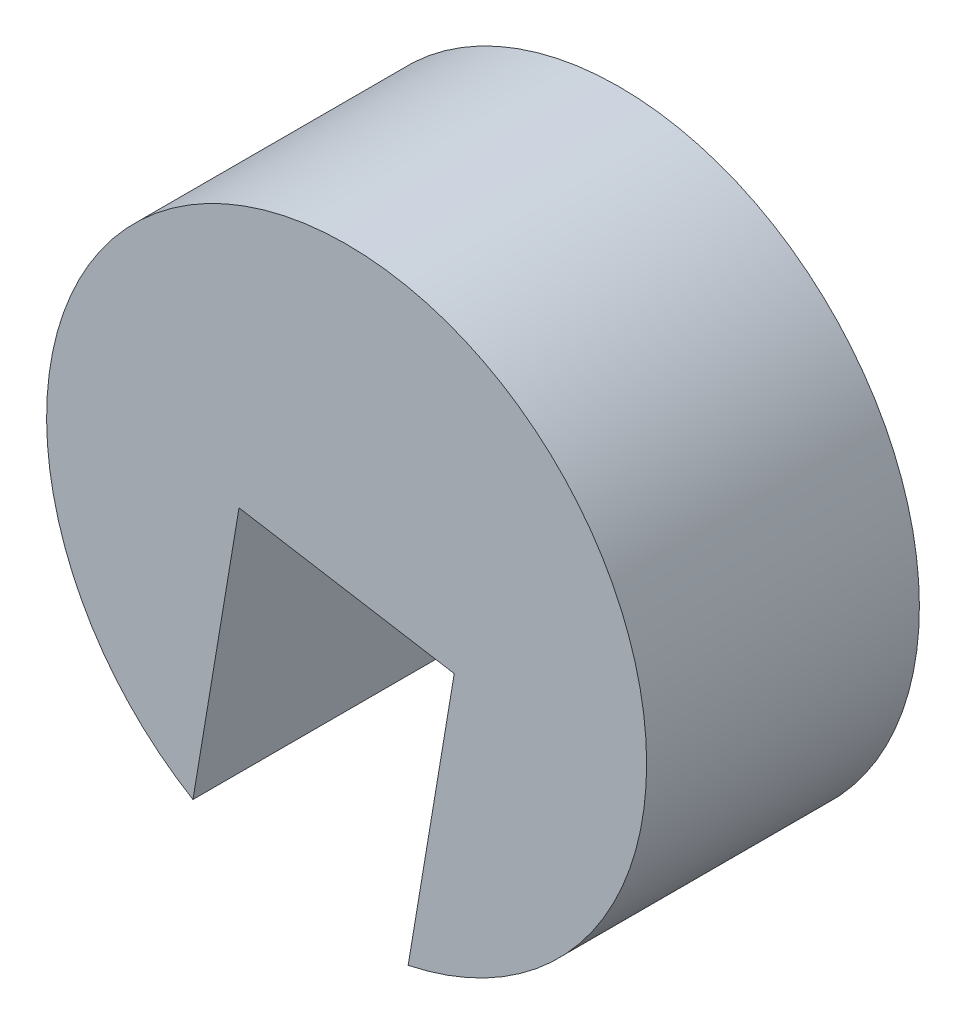
ISO-10303-21;
HEADER;
FILE_DESCRIPTION(('STEP AP214'),'2;1');
FILE_NAME('part.step','',(''),(''),'','','');
FILE_SCHEMA(('AUTOMOTIVE_DESIGN { 1 0 10303 214 1 1 1 1 }'));
ENDSEC;
DATA;
#1=APPLICATION_CONTEXT('core data for automotive mechanical design processes');
#2=APPLICATION_PROTOCOL_DEFINITION('international standard','automotive_design',2000,#1);
#3=PRODUCT_CONTEXT('',#1,'mechanical');
#4=PRODUCT('Part','Part','',(#3));
#5=PRODUCT_RELATED_PRODUCT_CATEGORY('part','',(#4));
#6=PRODUCT_DEFINITION_FORMATION('','',#4);
#7=PRODUCT_DEFINITION_CONTEXT('part definition',#1,'design');
#8=PRODUCT_DEFINITION('design','',#6,#7);
#9=PRODUCT_DEFINITION_SHAPE('','',#8);
#10=(LENGTH_UNIT() NAMED_UNIT(*) SI_UNIT(.MILLI.,.METRE.));
#11=(NAMED_UNIT(*) PLANE_ANGLE_UNIT() SI_UNIT($,.RADIAN.));
#12=(NAMED_UNIT(*) SI_UNIT($,.STERADIAN.) SOLID_ANGLE_UNIT());
#13=UNCERTAINTY_MEASURE_WITH_UNIT(LENGTH_MEASURE(1.E-05),#10,'distance_accuracy_value','');
#14=(GEOMETRIC_REPRESENTATION_CONTEXT(3) GLOBAL_UNCERTAINTY_ASSIGNED_CONTEXT((#13)) GLOBAL_UNIT_ASSIGNED_CONTEXT((#10,
#11,#12)) REPRESENTATION_CONTEXT('',''));
#15=CARTESIAN_POINT('',(0.,0.,0.));
#16=DIRECTION('',(0.,0.,1.));
#17=DIRECTION('',(1.,0.,0.));
#18=AXIS2_PLACEMENT_3D('',#15,#16,#17);
#19=CARTESIAN_POINT('',(0.,0.,5.));
#20=DIRECTION('',(0.,0.,-1.));
#21=DIRECTION('',(-1.,0.,0.));
#22=AXIS2_PLACEMENT_3D('',#19,#20,#21);
#23=CYLINDRICAL_SURFACE('',#22,5.5);
#24=CARTESIAN_POINT('',(0.,0.,5.));
#25=DIRECTION('',(0.,0.,1.));
#26=DIRECTION('',(1.,0.,0.));
#27=AXIS2_PLACEMENT_3D('',#24,#25,#26);
#28=CIRCLE('',#27,5.5);
#29=CARTESIAN_POINT('',(1.12806532229737,-5.38307241532474,5.));
#30=VERTEX_POINT('',#29);
#31=CARTESIAN_POINT('',(-2.81721330901617,-4.72369655794084,5.));
#32=VERTEX_POINT('',#31);
#33=EDGE_CURVE('E11',#30,#32,#28,.T.);
#34=ORIENTED_EDGE('',*,*,#33,.F.);
#35=DIRECTION('',(0.,0.,1.));
#36=VECTOR('',#35,1.);
#37=CARTESIAN_POINT('',(1.12806532229737,-5.38307241532474,0.));
#38=LINE('',#37,#36);
#39=CARTESIAN_POINT('',(1.12806532229737,-5.38307241532474,0.));
#40=VERTEX_POINT('',#39);
#41=EDGE_CURVE('E88',#40,#30,#38,.T.);
#42=ORIENTED_EDGE('',*,*,#41,.F.);
#43=CARTESIAN_POINT('',(0.,0.,0.));
#44=DIRECTION('',(0.,0.,1.));
#45=DIRECTION('',(1.,0.,0.));
#46=AXIS2_PLACEMENT_3D('',#43,#44,#45);
#47=CIRCLE('',#46,5.5);
#48=CARTESIAN_POINT('',(-2.81721330901617,-4.72369655794084,0.));
#49=VERTEX_POINT('',#48);
#50=EDGE_CURVE('E47',#40,#49,#47,.T.);
#51=ORIENTED_EDGE('',*,*,#50,.T.);
#52=DIRECTION('',(0.,0.,1.));
#53=VECTOR('',#52,1.);
#54=CARTESIAN_POINT('',(-2.81721330901617,-4.72369655794084,0.));
#55=LINE('',#54,#53);
#56=EDGE_CURVE('E80',#49,#32,#55,.T.);
#57=ORIENTED_EDGE('',*,*,#56,.T.);
#58=EDGE_LOOP('',(#34,#42,#51,#57));
#59=FACE_BOUND('',#58,.T.);
#60=ADVANCED_FACE('F39',(#59),#23,.T.);
#61=CARTESIAN_POINT('',(0.,0.,5.));
#62=DIRECTION('',(0.,0.,1.));
#63=DIRECTION('',(1.,0.,0.));
#64=AXIS2_PLACEMENT_3D('',#61,#62,#63);
#65=PLANE('',#64);
#66=DIRECTION('',(0.164843964345974,0.986319657828385,0.));
#67=VECTOR('',#66,1.);
#68=CARTESIAN_POINT('',(1.97263931565677,-0.329687928691948,5.));
#69=LINE('',#68,#67);
#70=CARTESIAN_POINT('',(1.97263931565677,-0.329687928691948,5.));
#71=VERTEX_POINT('',#70);
#72=EDGE_CURVE('E111',#30,#71,#69,.T.);
#73=ORIENTED_EDGE('',*,*,#72,.F.);
#74=ORIENTED_EDGE('',*,*,#33,.T.);
#75=DIRECTION('',(-0.164843964345974,-0.986319657828385,0.));
#76=VECTOR('',#75,1.);
#77=CARTESIAN_POINT('',(-1.97263931565677,0.329687928691948,5.));
#78=LINE('',#77,#76);
#79=CARTESIAN_POINT('',(-1.97263931565677,0.329687928691948,5.));
#80=VERTEX_POINT('',#79);
#81=EDGE_CURVE('E83',#80,#32,#78,.T.);
#82=ORIENTED_EDGE('',*,*,#81,.F.);
#83=DIRECTION('',(-0.986319657828385,0.164843964345974,0.));
#84=VECTOR('',#83,1.);
#85=CARTESIAN_POINT('',(0.,0.,5.));
#86=LINE('',#85,#84);
#87=EDGE_CURVE('E128',#71,#80,#86,.T.);
#88=ORIENTED_EDGE('',*,*,#87,.F.);
#89=EDGE_LOOP('',(#73,#74,#82,#88));
#90=FACE_BOUND('',#89,.T.);
#91=ADVANCED_FACE('F140',(#90),#65,.T.);
#92=CARTESIAN_POINT('',(0.,0.,0.));
#93=DIRECTION('',(0.,0.,1.));
#94=DIRECTION('',(1.,0.,0.));
#95=AXIS2_PLACEMENT_3D('',#92,#93,#94);
#96=PLANE('',#95);
#97=ORIENTED_EDGE('',*,*,#50,.F.);
#98=DIRECTION('',(0.164843964345974,0.986319657828385,0.));
#99=VECTOR('',#98,1.);
#100=CARTESIAN_POINT('',(1.97263931565677,-0.329687928691948,0.));
#101=LINE('',#100,#99);
#102=CARTESIAN_POINT('',(1.97263931565677,-0.329687928691948,0.));
#103=VERTEX_POINT('',#102);
#104=EDGE_CURVE('E98',#40,#103,#101,.T.);
#105=ORIENTED_EDGE('',*,*,#104,.T.);
#106=DIRECTION('',(-0.986319657828385,0.164843964345974,0.));
#107=VECTOR('',#106,1.);
#108=CARTESIAN_POINT('',(0.,0.,0.));
#109=LINE('',#108,#107);
#110=CARTESIAN_POINT('',(-1.97263931565677,0.329687928691948,0.));
#111=VERTEX_POINT('',#110);
#112=EDGE_CURVE('E96',#103,#111,#109,.T.);
#113=ORIENTED_EDGE('',*,*,#112,.T.);
#114=DIRECTION('',(-0.164843964345974,-0.986319657828385,0.));
#115=VECTOR('',#114,1.);
#116=CARTESIAN_POINT('',(-1.97263931565677,0.329687928691948,0.));
#117=LINE('',#116,#115);
#118=EDGE_CURVE('E54',#111,#49,#117,.T.);
#119=ORIENTED_EDGE('',*,*,#118,.T.);
#120=EDGE_LOOP('',(#97,#105,#113,#119));
#121=FACE_BOUND('',#120,.T.);
#122=ADVANCED_FACE('F94',(#121),#96,.F.);
#123=CARTESIAN_POINT('',(1.97263931565677,-0.329687928691948,0.));
#124=DIRECTION('',(0.986319657828385,-0.164843964345974,0.));
#125=DIRECTION('',(0.164843964345974,0.986319657828386,0.));
#126=AXIS2_PLACEMENT_3D('',#123,#124,#125);
#127=PLANE('',#126);
#128=ORIENTED_EDGE('',*,*,#72,.T.);
#129=DIRECTION('',(0.,0.,1.));
#130=VECTOR('',#129,1.);
#131=CARTESIAN_POINT('',(1.97263931565677,-0.329687928691948,0.));
#132=LINE('',#131,#130);
#133=EDGE_CURVE('E63',#103,#71,#132,.T.);
#134=ORIENTED_EDGE('',*,*,#133,.F.);
#135=ORIENTED_EDGE('',*,*,#104,.F.);
#136=ORIENTED_EDGE('',*,*,#41,.T.);
#137=EDGE_LOOP('',(#128,#134,#135,#136));
#138=FACE_BOUND('',#137,.T.);
#139=ADVANCED_FACE('F141',(#138),#127,.F.);
#140=CARTESIAN_POINT('',(-1.97263931565677,0.329687928691948,0.));
#141=DIRECTION('',(-0.986319657828385,0.164843964345974,0.));
#142=DIRECTION('',(-0.164843964345974,-0.986319657828385,0.));
#143=AXIS2_PLACEMENT_3D('',#140,#141,#142);
#144=PLANE('',#143);
#145=ORIENTED_EDGE('',*,*,#81,.T.);
#146=ORIENTED_EDGE('',*,*,#56,.F.);
#147=ORIENTED_EDGE('',*,*,#118,.F.);
#148=DIRECTION('',(0.,0.,1.));
#149=VECTOR('',#148,1.);
#150=CARTESIAN_POINT('',(-1.97263931565677,0.329687928691948,0.));
#151=LINE('',#150,#149);
#152=EDGE_CURVE('E89',#111,#80,#151,.T.);
#153=ORIENTED_EDGE('',*,*,#152,.T.);
#154=EDGE_LOOP('',(#145,#146,#147,#153));
#155=FACE_BOUND('',#154,.T.);
#156=ADVANCED_FACE('F81',(#155),#144,.F.);
#157=CARTESIAN_POINT('',(0.,0.,0.));
#158=DIRECTION('',(0.164843964345974,0.986319657828385,0.));
#159=DIRECTION('',(-0.986319657828386,0.164843964345974,0.));
#160=AXIS2_PLACEMENT_3D('',#157,#158,#159);
#161=PLANE('',#160);
#162=ORIENTED_EDGE('',*,*,#87,.T.);
#163=ORIENTED_EDGE('',*,*,#152,.F.);
#164=ORIENTED_EDGE('',*,*,#112,.F.);
#165=ORIENTED_EDGE('',*,*,#133,.T.);
#166=EDGE_LOOP('',(#162,#163,#164,#165));
#167=FACE_BOUND('',#166,.T.);
#168=ADVANCED_FACE('F137',(#167),#161,.F.);
#169=CLOSED_SHELL('',(#60,#91,#122,#139,#156,#168));
#170=MANIFOLD_SOLID_BREP('B2',#169);
#171=ADVANCED_BREP_SHAPE_REPRESENTATION('',(#18,#170),#14);
#172=SHAPE_DEFINITION_REPRESENTATION(#9,#171);
ENDSEC;
END-ISO-10303-21;
